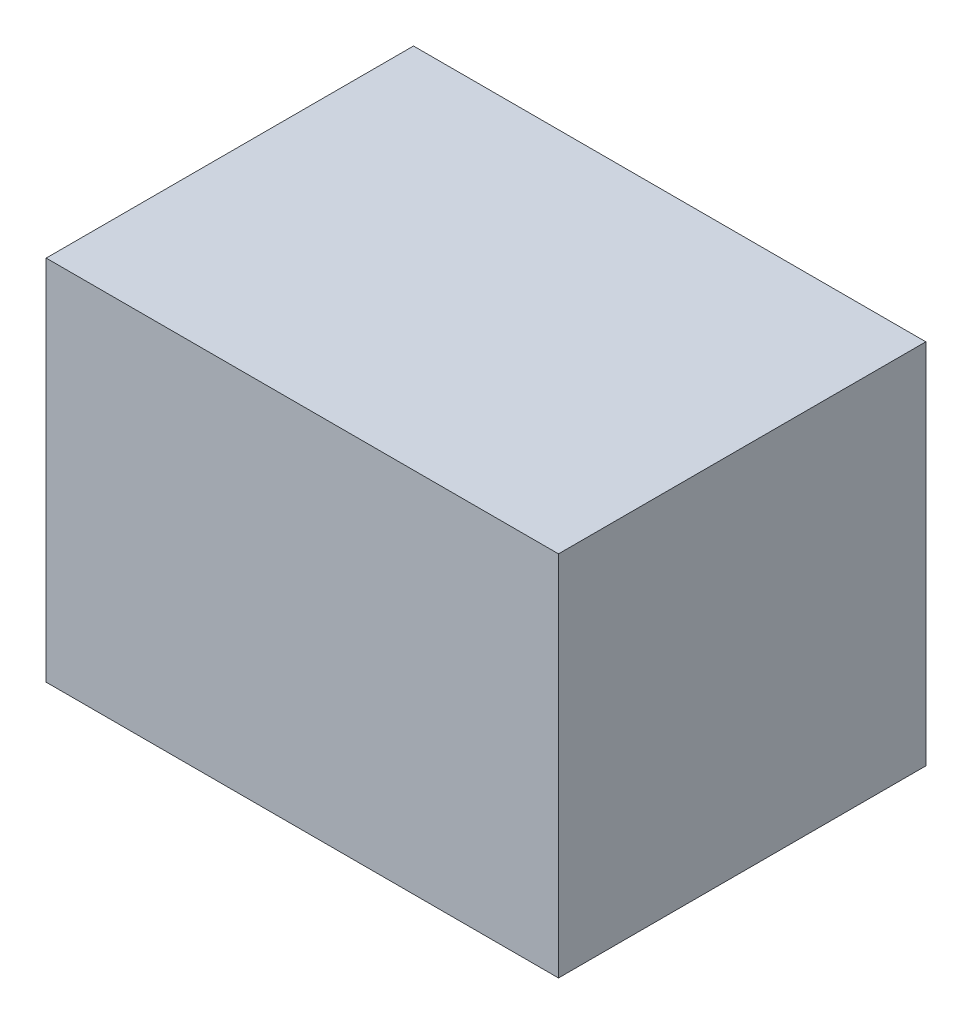
ISO-10303-21;
HEADER;
FILE_DESCRIPTION(('STEP AP214'),'2;1');
FILE_NAME('part.step','',(''),(''),'','','');
FILE_SCHEMA(('AUTOMOTIVE_DESIGN { 1 0 10303 214 1 1 1 1 }'));
ENDSEC;
DATA;
#1=APPLICATION_CONTEXT('core data for automotive mechanical design processes');
#2=APPLICATION_PROTOCOL_DEFINITION('international standard','automotive_design',2000,#1);
#3=PRODUCT_CONTEXT('',#1,'mechanical');
#4=PRODUCT('Part','Part','',(#3));
#5=PRODUCT_RELATED_PRODUCT_CATEGORY('part','',(#4));
#6=PRODUCT_DEFINITION_FORMATION('','',#4);
#7=PRODUCT_DEFINITION_CONTEXT('part definition',#1,'design');
#8=PRODUCT_DEFINITION('design','',#6,#7);
#9=PRODUCT_DEFINITION_SHAPE('','',#8);
#10=(LENGTH_UNIT() NAMED_UNIT(*) SI_UNIT(.MILLI.,.METRE.));
#11=(NAMED_UNIT(*) PLANE_ANGLE_UNIT() SI_UNIT($,.RADIAN.));
#12=(NAMED_UNIT(*) SI_UNIT($,.STERADIAN.) SOLID_ANGLE_UNIT());
#13=UNCERTAINTY_MEASURE_WITH_UNIT(LENGTH_MEASURE(1.E-05),#10,'distance_accuracy_value','');
#14=(GEOMETRIC_REPRESENTATION_CONTEXT(3) GLOBAL_UNCERTAINTY_ASSIGNED_CONTEXT((#13)) GLOBAL_UNIT_ASSIGNED_CONTEXT((#10,
#11,#12)) REPRESENTATION_CONTEXT('',''));
#15=CARTESIAN_POINT('',(0.,0.,0.));
#16=DIRECTION('',(0.,0.,1.));
#17=DIRECTION('',(1.,0.,0.));
#18=AXIS2_PLACEMENT_3D('',#15,#16,#17);
#19=CARTESIAN_POINT('',(0.,0.,38.));
#20=DIRECTION('',(1.,0.,0.));
#21=DIRECTION('',(0.,0.,-1.));
#22=AXIS2_PLACEMENT_3D('',#19,#20,#21);
#23=PLANE('',#22);
#24=DIRECTION('',(0.,-1.,0.));
#25=VECTOR('',#24,1.);
#26=CARTESIAN_POINT('',(0.,0.,0.));
#27=LINE('',#26,#25);
#28=CARTESIAN_POINT('',(0.,38.,0.));
#29=VERTEX_POINT('',#28);
#30=CARTESIAN_POINT('',(0.,0.,0.));
#31=VERTEX_POINT('',#30);
#32=EDGE_CURVE('E100',#29,#31,#27,.T.);
#33=ORIENTED_EDGE('',*,*,#32,.T.);
#34=DIRECTION('',(0.,0.,-1.));
#35=VECTOR('',#34,1.);
#36=CARTESIAN_POINT('',(0.,0.,38.));
#37=LINE('',#36,#35);
#38=CARTESIAN_POINT('',(0.,0.,38.));
#39=VERTEX_POINT('',#38);
#40=EDGE_CURVE('E11',#39,#31,#37,.T.);
#41=ORIENTED_EDGE('',*,*,#40,.F.);
#42=DIRECTION('',(0.,-1.,0.));
#43=VECTOR('',#42,1.);
#44=CARTESIAN_POINT('',(0.,0.,38.));
#45=LINE('',#44,#43);
#46=CARTESIAN_POINT('',(0.,38.,38.));
#47=VERTEX_POINT('',#46);
#48=EDGE_CURVE('E88',#47,#39,#45,.T.);
#49=ORIENTED_EDGE('',*,*,#48,.F.);
#50=DIRECTION('',(0.,0.,-1.));
#51=VECTOR('',#50,1.);
#52=CARTESIAN_POINT('',(0.,38.,38.));
#53=LINE('',#52,#51);
#54=EDGE_CURVE('E96',#47,#29,#53,.T.);
#55=ORIENTED_EDGE('',*,*,#54,.T.);
#56=EDGE_LOOP('',(#33,#41,#49,#55));
#57=FACE_BOUND('',#56,.T.);
#58=ADVANCED_FACE('F37',(#57),#23,.F.);
#59=CARTESIAN_POINT('',(0.,0.,38.));
#60=DIRECTION('',(0.,1.,0.));
#61=DIRECTION('',(0.,0.,1.));
#62=AXIS2_PLACEMENT_3D('',#59,#60,#61);
#63=PLANE('',#62);
#64=DIRECTION('',(1.,0.,0.));
#65=VECTOR('',#64,1.);
#66=CARTESIAN_POINT('',(0.,0.,0.));
#67=LINE('',#66,#65);
#68=CARTESIAN_POINT('',(53.,0.,0.));
#69=VERTEX_POINT('',#68);
#70=EDGE_CURVE('E92',#31,#69,#67,.T.);
#71=ORIENTED_EDGE('',*,*,#70,.T.);
#72=DIRECTION('',(0.,0.,-1.));
#73=VECTOR('',#72,1.);
#74=CARTESIAN_POINT('',(53.,0.,38.));
#75=LINE('',#74,#73);
#76=CARTESIAN_POINT('',(53.,0.,38.));
#77=VERTEX_POINT('',#76);
#78=EDGE_CURVE('E45',#77,#69,#75,.T.);
#79=ORIENTED_EDGE('',*,*,#78,.F.);
#80=DIRECTION('',(1.,0.,0.));
#81=VECTOR('',#80,1.);
#82=CARTESIAN_POINT('',(0.,0.,38.));
#83=LINE('',#82,#81);
#84=EDGE_CURVE('E83',#39,#77,#83,.T.);
#85=ORIENTED_EDGE('',*,*,#84,.F.);
#86=ORIENTED_EDGE('',*,*,#40,.T.);
#87=EDGE_LOOP('',(#71,#79,#85,#86));
#88=FACE_BOUND('',#87,.T.);
#89=ADVANCED_FACE('F91',(#88),#63,.F.);
#90=CARTESIAN_POINT('',(53.,0.,38.));
#91=DIRECTION('',(-1.,0.,0.));
#92=DIRECTION('',(0.,0.,1.));
#93=AXIS2_PLACEMENT_3D('',#90,#91,#92);
#94=PLANE('',#93);
#95=DIRECTION('',(0.,1.,0.));
#96=VECTOR('',#95,1.);
#97=CARTESIAN_POINT('',(53.,0.,0.));
#98=LINE('',#97,#96);
#99=CARTESIAN_POINT('',(53.,38.,0.));
#100=VERTEX_POINT('',#99);
#101=EDGE_CURVE('E70',#69,#100,#98,.T.);
#102=ORIENTED_EDGE('',*,*,#101,.T.);
#103=DIRECTION('',(0.,0.,-1.));
#104=VECTOR('',#103,1.);
#105=CARTESIAN_POINT('',(53.,38.,38.));
#106=LINE('',#105,#104);
#107=CARTESIAN_POINT('',(53.,38.,38.));
#108=VERTEX_POINT('',#107);
#109=EDGE_CURVE('E93',#108,#100,#106,.T.);
#110=ORIENTED_EDGE('',*,*,#109,.F.);
#111=DIRECTION('',(0.,1.,0.));
#112=VECTOR('',#111,1.);
#113=CARTESIAN_POINT('',(53.,0.,38.));
#114=LINE('',#113,#112);
#115=EDGE_CURVE('E86',#77,#108,#114,.T.);
#116=ORIENTED_EDGE('',*,*,#115,.F.);
#117=ORIENTED_EDGE('',*,*,#78,.T.);
#118=EDGE_LOOP('',(#102,#110,#116,#117));
#119=FACE_BOUND('',#118,.T.);
#120=ADVANCED_FACE('F94',(#119),#94,.F.);
#121=CARTESIAN_POINT('',(0.,38.,38.));
#122=DIRECTION('',(0.,-1.,0.));
#123=DIRECTION('',(0.,0.,-1.));
#124=AXIS2_PLACEMENT_3D('',#121,#122,#123);
#125=PLANE('',#124);
#126=DIRECTION('',(-1.,0.,0.));
#127=VECTOR('',#126,1.);
#128=CARTESIAN_POINT('',(0.,38.,0.));
#129=LINE('',#128,#127);
#130=EDGE_CURVE('E76',#100,#29,#129,.T.);
#131=ORIENTED_EDGE('',*,*,#130,.T.);
#132=ORIENTED_EDGE('',*,*,#54,.F.);
#133=DIRECTION('',(-1.,0.,0.));
#134=VECTOR('',#133,1.);
#135=CARTESIAN_POINT('',(0.,38.,38.));
#136=LINE('',#135,#134);
#137=EDGE_CURVE('E53',#108,#47,#136,.T.);
#138=ORIENTED_EDGE('',*,*,#137,.F.);
#139=ORIENTED_EDGE('',*,*,#109,.T.);
#140=EDGE_LOOP('',(#131,#132,#138,#139));
#141=FACE_BOUND('',#140,.T.);
#142=ADVANCED_FACE('F107',(#141),#125,.F.);
#143=CARTESIAN_POINT('',(0.,0.,38.));
#144=DIRECTION('',(0.,0.,-1.));
#145=DIRECTION('',(-1.,0.,0.));
#146=AXIS2_PLACEMENT_3D('',#143,#144,#145);
#147=PLANE('',#146);
#148=ORIENTED_EDGE('',*,*,#48,.T.);
#149=ORIENTED_EDGE('',*,*,#84,.T.);
#150=ORIENTED_EDGE('',*,*,#115,.T.);
#151=ORIENTED_EDGE('',*,*,#137,.T.);
#152=EDGE_LOOP('',(#148,#149,#150,#151));
#153=FACE_BOUND('',#152,.T.);
#154=ADVANCED_FACE('F84',(#153),#147,.F.);
#155=CARTESIAN_POINT('',(0.,0.,0.));
#156=DIRECTION('',(0.,0.,-1.));
#157=DIRECTION('',(-1.,0.,0.));
#158=AXIS2_PLACEMENT_3D('',#155,#156,#157);
#159=PLANE('',#158);
#160=ORIENTED_EDGE('',*,*,#32,.F.);
#161=ORIENTED_EDGE('',*,*,#130,.F.);
#162=ORIENTED_EDGE('',*,*,#101,.F.);
#163=ORIENTED_EDGE('',*,*,#70,.F.);
#164=EDGE_LOOP('',(#160,#161,#162,#163));
#165=FACE_BOUND('',#164,.T.);
#166=ADVANCED_FACE('F110',(#165),#159,.T.);
#167=CLOSED_SHELL('',(#58,#89,#120,#142,#154,#166));
#168=MANIFOLD_SOLID_BREP('B2',#167);
#169=ADVANCED_BREP_SHAPE_REPRESENTATION('',(#18,#168),#14);
#170=SHAPE_DEFINITION_REPRESENTATION(#9,#169);
ENDSEC;
END-ISO-10303-21;
